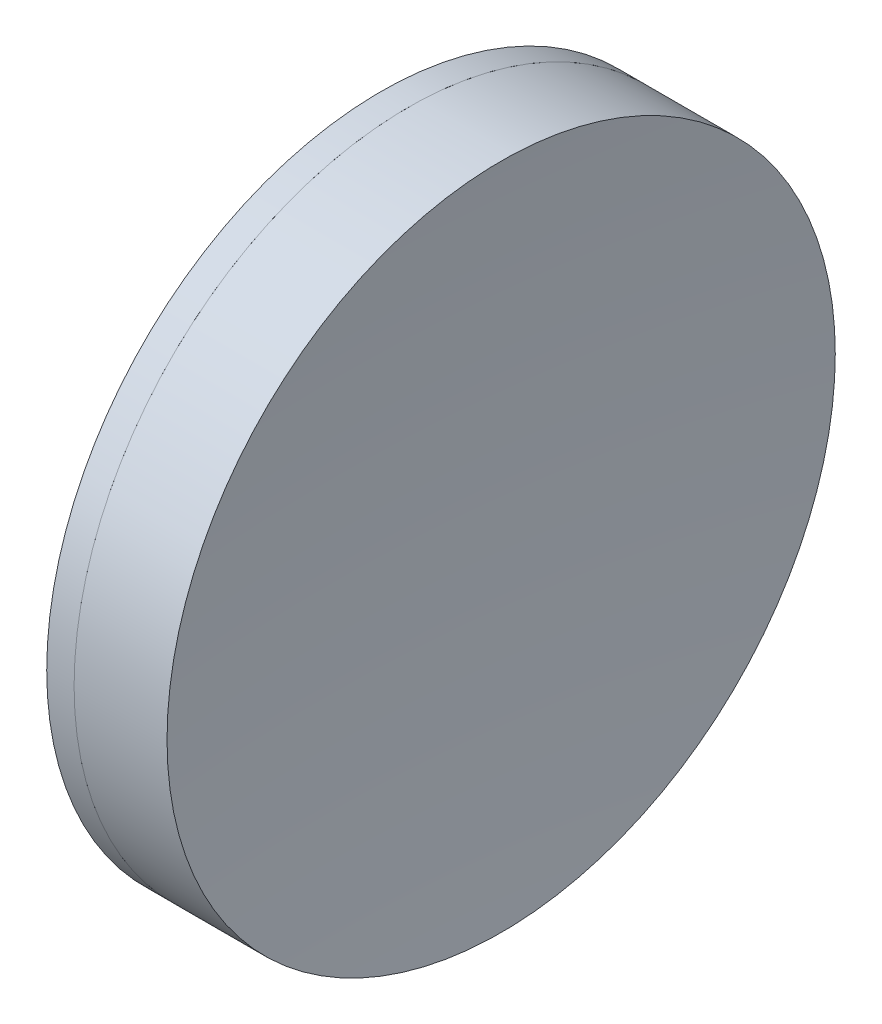
ISO-10303-21;
HEADER;
FILE_DESCRIPTION(('STEP AP214'),'2;1');
FILE_NAME('part.step','',(''),(''),'','','');
FILE_SCHEMA(('AUTOMOTIVE_DESIGN { 1 0 10303 214 1 1 1 1 }'));
ENDSEC;
DATA;
#1=APPLICATION_CONTEXT('core data for automotive mechanical design processes');
#2=APPLICATION_PROTOCOL_DEFINITION('international standard','automotive_design',2000,#1);
#3=PRODUCT_CONTEXT('',#1,'mechanical');
#4=PRODUCT('Part','Part','',(#3));
#5=PRODUCT_RELATED_PRODUCT_CATEGORY('part','',(#4));
#6=PRODUCT_DEFINITION_FORMATION('','',#4);
#7=PRODUCT_DEFINITION_CONTEXT('part definition',#1,'design');
#8=PRODUCT_DEFINITION('design','',#6,#7);
#9=PRODUCT_DEFINITION_SHAPE('','',#8);
#10=(LENGTH_UNIT() NAMED_UNIT(*) SI_UNIT(.MILLI.,.METRE.));
#11=(NAMED_UNIT(*) PLANE_ANGLE_UNIT() SI_UNIT($,.RADIAN.));
#12=(NAMED_UNIT(*) SI_UNIT($,.STERADIAN.) SOLID_ANGLE_UNIT());
#13=UNCERTAINTY_MEASURE_WITH_UNIT(LENGTH_MEASURE(1.E-05),#10,'distance_accuracy_value','');
#14=(GEOMETRIC_REPRESENTATION_CONTEXT(3) GLOBAL_UNCERTAINTY_ASSIGNED_CONTEXT((#13)) GLOBAL_UNIT_ASSIGNED_CONTEXT((#10,
#11,#12)) REPRESENTATION_CONTEXT('',''));
#15=CARTESIAN_POINT('',(0.,0.,0.));
#16=DIRECTION('',(0.,0.,1.));
#17=DIRECTION('',(1.,0.,0.));
#18=AXIS2_PLACEMENT_3D('',#15,#16,#17);
#19=CARTESIAN_POINT('',(44.3647689612468,0.,0.));
#20=DIRECTION('',(-1.,0.,0.));
#21=DIRECTION('',(0.,0.,-1.));
#22=AXIS2_PLACEMENT_3D('',#19,#20,#21);
#23=SPHERICAL_SURFACE('',#22,112.21);
#24=CARTESIAN_POINT('',(153.66218018402,0.,0.));
#25=DIRECTION('',(-1.,0.,0.));
#26=DIRECTION('',(0.,0.,1.));
#27=AXIS2_PLACEMENT_3D('',#24,#25,#26);
#28=CIRCLE('',#27,25.3999999999999);
#29=CARTESIAN_POINT('',(153.66218018402,0.,25.3999999999999));
#30=VERTEX_POINT('',#29);
#31=EDGE_CURVE('E51',#30,#30,#28,.T.);
#32=ORIENTED_EDGE('',*,*,#31,.T.);
#33=EDGE_LOOP('',(#32));
#34=FACE_BOUND('',#33,.T.);
#35=ADVANCED_FACE('F45',(#34),#23,.F.);
#36=CARTESIAN_POINT('',(440.124768961247,0.,0.));
#37=DIRECTION('',(-1.,0.,0.));
#38=DIRECTION('',(0.,0.,-1.));
#39=AXIS2_PLACEMENT_3D('',#36,#37,#38);
#40=SPHERICAL_SURFACE('',#39,280.55);
#41=CARTESIAN_POINT('',(160.72694774569,0.,0.));
#42=DIRECTION('',(-1.,0.,0.));
#43=DIRECTION('',(0.,0.,1.));
#44=AXIS2_PLACEMENT_3D('',#41,#42,#43);
#45=CIRCLE('',#44,25.3999999999999);
#46=CARTESIAN_POINT('',(160.72694774569,0.,25.3999999999999));
#47=VERTEX_POINT('',#46);
#48=EDGE_CURVE('E11',#47,#47,#45,.T.);
#49=ORIENTED_EDGE('',*,*,#48,.F.);
#50=EDGE_LOOP('',(#49));
#51=FACE_BOUND('',#50,.T.);
#52=ADVANCED_FACE('F60',(#51),#40,.F.);
#53=CARTESIAN_POINT('',(-0.551919992657797,0.,0.));
#54=DIRECTION('',(-1.,0.,0.));
#55=DIRECTION('',(0.,0.,1.));
#56=AXIS2_PLACEMENT_3D('',#53,#54,#55);
#57=CYLINDRICAL_SURFACE('',#56,25.3999999999999);
#58=ORIENTED_EDGE('',*,*,#48,.T.);
#59=EDGE_LOOP('',(#58));
#60=FACE_BOUND('',#59,.T.);
#61=ORIENTED_EDGE('',*,*,#31,.F.);
#62=EDGE_LOOP('',(#61));
#63=FACE_BOUND('',#62,.T.);
#64=ADVANCED_FACE('F58',(#60,#63),#57,.T.);
#65=CLOSED_SHELL('',(#35,#52,#64));
#66=MANIFOLD_SOLID_BREP('B2',#65);
#67=CARTESIAN_POINT('',(241.834768961247,0.,0.));
#68=DIRECTION('',(-1.,0.,0.));
#69=DIRECTION('',(0.,0.,1.));
#70=AXIS2_PLACEMENT_3D('',#67,#68,#69);
#71=SPHERICAL_SURFACE('',#70,93.76);
#72=CARTESIAN_POINT('',(151.580807275346,0.,0.));
#73=DIRECTION('',(-1.,0.,0.));
#74=DIRECTION('',(0.,0.,1.));
#75=AXIS2_PLACEMENT_3D('',#72,#73,#74);
#76=CIRCLE('',#75,25.4);
#77=CARTESIAN_POINT('',(151.580807275346,0.,25.4));
#78=VERTEX_POINT('',#77);
#79=EDGE_CURVE('E44',#78,#78,#76,.T.);
#80=ORIENTED_EDGE('',*,*,#79,.T.);
#81=EDGE_LOOP('',(#80));
#82=FACE_BOUND('',#81,.T.);
#83=ADVANCED_FACE('F86',(#82),#71,.T.);
#84=CARTESIAN_POINT('',(-0.816062176165804,0.,0.));
#85=DIRECTION('',(-1.,0.,0.));
#86=DIRECTION('',(0.,0.,1.));
#87=AXIS2_PLACEMENT_3D('',#84,#85,#86);
#88=CYLINDRICAL_SURFACE('',#87,25.4);
#89=CARTESIAN_POINT('',(153.66218018402,0.,0.));
#90=DIRECTION('',(-1.,0.,0.));
#91=DIRECTION('',(0.,0.,1.));
#92=AXIS2_PLACEMENT_3D('',#89,#90,#91);
#93=CIRCLE('',#92,25.4);
#94=CARTESIAN_POINT('',(153.66218018402,0.,25.4));
#95=VERTEX_POINT('',#94);
#96=EDGE_CURVE('E92',#95,#95,#93,.T.);
#97=ORIENTED_EDGE('',*,*,#96,.T.);
#98=EDGE_LOOP('',(#97));
#99=FACE_BOUND('',#98,.T.);
#100=ORIENTED_EDGE('',*,*,#79,.F.);
#101=EDGE_LOOP('',(#100));
#102=FACE_BOUND('',#101,.T.);
#103=ADVANCED_FACE('F98',(#99,#102),#88,.T.);
#104=CARTESIAN_POINT('',(44.3647689612468,0.,0.));
#105=DIRECTION('',(-1.,0.,0.));
#106=DIRECTION('',(0.,0.,1.));
#107=AXIS2_PLACEMENT_3D('',#104,#105,#106);
#108=SPHERICAL_SURFACE('',#107,112.21);
#109=ORIENTED_EDGE('',*,*,#96,.F.);
#110=EDGE_LOOP('',(#109));
#111=FACE_BOUND('',#110,.T.);
#112=ADVANCED_FACE('F101',(#111),#108,.T.);
#113=CLOSED_SHELL('',(#83,#103,#112));
#114=MANIFOLD_SOLID_BREP('B6',#113);
#115=ADVANCED_BREP_SHAPE_REPRESENTATION('',(#18,#66,#114),#14);
#116=SHAPE_DEFINITION_REPRESENTATION(#9,#115);
ENDSEC;
END-ISO-10303-21;
